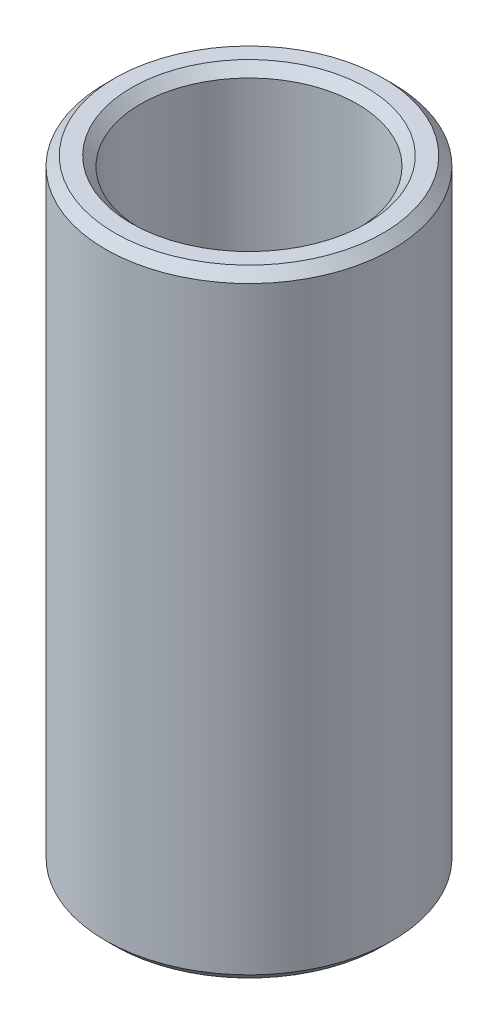
ISO-10303-21;
HEADER;
FILE_DESCRIPTION(('STEP AP214'),'2;1');
FILE_NAME('part.step','',(''),(''),'','','');
FILE_SCHEMA(('AUTOMOTIVE_DESIGN { 1 0 10303 214 1 1 1 1 }'));
ENDSEC;
DATA;
#1=APPLICATION_CONTEXT('core data for automotive mechanical design processes');
#2=APPLICATION_PROTOCOL_DEFINITION('international standard','automotive_design',2000,#1);
#3=PRODUCT_CONTEXT('',#1,'mechanical');
#4=PRODUCT('Part','Part','',(#3));
#5=PRODUCT_RELATED_PRODUCT_CATEGORY('part','',(#4));
#6=PRODUCT_DEFINITION_FORMATION('','',#4);
#7=PRODUCT_DEFINITION_CONTEXT('part definition',#1,'design');
#8=PRODUCT_DEFINITION('design','',#6,#7);
#9=PRODUCT_DEFINITION_SHAPE('','',#8);
#10=(LENGTH_UNIT() NAMED_UNIT(*) SI_UNIT(.MILLI.,.METRE.));
#11=(NAMED_UNIT(*) PLANE_ANGLE_UNIT() SI_UNIT($,.RADIAN.));
#12=(NAMED_UNIT(*) SI_UNIT($,.STERADIAN.) SOLID_ANGLE_UNIT());
#13=UNCERTAINTY_MEASURE_WITH_UNIT(LENGTH_MEASURE(1.E-05),#10,'distance_accuracy_value','');
#14=(GEOMETRIC_REPRESENTATION_CONTEXT(3) GLOBAL_UNCERTAINTY_ASSIGNED_CONTEXT((#13)) GLOBAL_UNIT_ASSIGNED_CONTEXT((#10,
#11,#12)) REPRESENTATION_CONTEXT('',''));
#15=CARTESIAN_POINT('',(0.,0.,0.));
#16=DIRECTION('',(0.,0.,1.));
#17=DIRECTION('',(1.,0.,0.));
#18=AXIS2_PLACEMENT_3D('',#15,#16,#17);
#19=CARTESIAN_POINT('',(0.,215.045325790434,0.));
#20=DIRECTION('',(0.,-1.,0.));
#21=DIRECTION('',(0.,0.,-1.));
#22=AXIS2_PLACEMENT_3D('',#19,#20,#21);
#23=CYLINDRICAL_SURFACE('',#22,50.);
#24=CARTESIAN_POINT('',(0.,3.25867300442437,0.));
#25=DIRECTION('',(0.,1.,0.));
#26=DIRECTION('',(0.,0.,1.));
#27=AXIS2_PLACEMENT_3D('',#24,#25,#26);
#28=CIRCLE('',#27,50.);
#29=CARTESIAN_POINT('',(0.,3.25867300442437,50.));
#30=VERTEX_POINT('',#29);
#31=EDGE_CURVE('E10',#30,#30,#28,.T.);
#32=ORIENTED_EDGE('',*,*,#31,.T.);
#33=EDGE_LOOP('',(#32));
#34=FACE_BOUND('',#33,.T.);
#35=CARTESIAN_POINT('',(0.,211.786652786009,0.));
#36=DIRECTION('',(0.,1.,0.));
#37=DIRECTION('',(0.,0.,1.));
#38=AXIS2_PLACEMENT_3D('',#35,#36,#37);
#39=CIRCLE('',#38,50.);
#40=CARTESIAN_POINT('',(0.,211.786652786009,50.));
#41=VERTEX_POINT('',#40);
#42=EDGE_CURVE('E50',#41,#41,#39,.F.);
#43=ORIENTED_EDGE('',*,*,#42,.T.);
#44=EDGE_LOOP('',(#43));
#45=FACE_BOUND('',#44,.T.);
#46=ADVANCED_FACE('F39',(#34,#45),#23,.T.);
#47=CARTESIAN_POINT('',(0.,215.045325790434,0.));
#48=DIRECTION('',(0.,1.,0.));
#49=DIRECTION('',(0.,0.,1.));
#50=AXIS2_PLACEMENT_3D('',#47,#48,#49);
#51=PLANE('',#50);
#52=CARTESIAN_POINT('',(0.,215.045325790434,0.));
#53=DIRECTION('',(0.,1.,0.));
#54=DIRECTION('',(0.,0.,1.));
#55=AXIS2_PLACEMENT_3D('',#52,#53,#54);
#56=CIRCLE('',#55,40.9631881952522);
#57=CARTESIAN_POINT('',(0.,215.045325790434,40.9631881952522));
#58=VERTEX_POINT('',#57);
#59=EDGE_CURVE('E58',#58,#58,#56,.F.);
#60=ORIENTED_EDGE('',*,*,#59,.T.);
#61=EDGE_LOOP('',(#60));
#62=FACE_BOUND('',#61,.T.);
#63=CARTESIAN_POINT('',(0.,215.045325790434,0.));
#64=DIRECTION('',(0.,1.,0.));
#65=DIRECTION('',(0.,0.,1.));
#66=AXIS2_PLACEMENT_3D('',#63,#64,#65);
#67=CIRCLE('',#66,46.7413269955755);
#68=CARTESIAN_POINT('',(0.,215.045325790434,46.7413269955755));
#69=VERTEX_POINT('',#68);
#70=EDGE_CURVE('E61',#69,#69,#67,.T.);
#71=ORIENTED_EDGE('',*,*,#70,.T.);
#72=EDGE_LOOP('',(#71));
#73=FACE_BOUND('',#72,.T.);
#74=ADVANCED_FACE('F88',(#62,#73),#51,.T.);
#75=CARTESIAN_POINT('',(0.,0.,0.));
#76=DIRECTION('',(0.,1.,0.));
#77=DIRECTION('',(0.,0.,1.));
#78=AXIS2_PLACEMENT_3D('',#75,#76,#77);
#79=PLANE('',#78);
#80=CARTESIAN_POINT('',(0.,0.,0.));
#81=DIRECTION('',(0.,1.,0.));
#82=DIRECTION('',(0.,0.,1.));
#83=AXIS2_PLACEMENT_3D('',#80,#81,#82);
#84=CIRCLE('',#83,40.9631881952522);
#85=CARTESIAN_POINT('',(0.,0.,40.9631881952522));
#86=VERTEX_POINT('',#85);
#87=EDGE_CURVE('E51',#86,#86,#84,.T.);
#88=ORIENTED_EDGE('',*,*,#87,.T.);
#89=EDGE_LOOP('',(#88));
#90=FACE_BOUND('',#89,.T.);
#91=CARTESIAN_POINT('',(0.,0.,0.));
#92=DIRECTION('',(0.,1.,0.));
#93=DIRECTION('',(0.,0.,1.));
#94=AXIS2_PLACEMENT_3D('',#91,#92,#93);
#95=CIRCLE('',#94,46.7413269955756);
#96=CARTESIAN_POINT('',(0.,0.,46.7413269955756));
#97=VERTEX_POINT('',#96);
#98=EDGE_CURVE('E54',#97,#97,#95,.F.);
#99=ORIENTED_EDGE('',*,*,#98,.T.);
#100=EDGE_LOOP('',(#99));
#101=FACE_BOUND('',#100,.T.);
#102=ADVANCED_FACE('F83',(#90,#101),#79,.F.);
#103=CARTESIAN_POINT('',(0.,215.045325790434,0.));
#104=DIRECTION('',(0.,-1.,0.));
#105=DIRECTION('',(0.,0.,-1.));
#106=AXIS2_PLACEMENT_3D('',#103,#104,#105);
#107=CYLINDRICAL_SURFACE('',#106,37.7045151908278);
#108=CARTESIAN_POINT('',(0.,211.786652786009,0.));
#109=DIRECTION('',(0.,1.,0.));
#110=DIRECTION('',(0.,0.,1.));
#111=AXIS2_PLACEMENT_3D('',#108,#109,#110);
#112=CIRCLE('',#111,37.7045151908278);
#113=CARTESIAN_POINT('',(0.,211.786652786009,37.7045151908278));
#114=VERTEX_POINT('',#113);
#115=EDGE_CURVE('E67',#114,#114,#112,.T.);
#116=ORIENTED_EDGE('',*,*,#115,.T.);
#117=EDGE_LOOP('',(#116));
#118=FACE_BOUND('',#117,.T.);
#119=CARTESIAN_POINT('',(0.,3.25867300442445,0.));
#120=DIRECTION('',(0.,1.,0.));
#121=DIRECTION('',(0.,0.,1.));
#122=AXIS2_PLACEMENT_3D('',#119,#120,#121);
#123=CIRCLE('',#122,37.7045151908278);
#124=CARTESIAN_POINT('',(0.,3.25867300442445,37.7045151908278));
#125=VERTEX_POINT('',#124);
#126=EDGE_CURVE('E69',#125,#125,#123,.F.);
#127=ORIENTED_EDGE('',*,*,#126,.T.);
#128=EDGE_LOOP('',(#127));
#129=FACE_BOUND('',#128,.T.);
#130=ADVANCED_FACE('F71',(#118,#129),#107,.F.);
#131=CARTESIAN_POINT('',(0.,211.786652786009,0.));
#132=DIRECTION('',(0.,1.,0.));
#133=DIRECTION('',(0.,0.,1.));
#134=AXIS2_PLACEMENT_3D('',#131,#132,#133);
#135=CONICAL_SURFACE('',#134,37.7045151908278,0.785398163397448);
#136=ORIENTED_EDGE('',*,*,#59,.F.);
#137=EDGE_LOOP('',(#136));
#138=FACE_BOUND('',#137,.T.);
#139=ORIENTED_EDGE('',*,*,#115,.F.);
#140=EDGE_LOOP('',(#139));
#141=FACE_BOUND('',#140,.T.);
#142=ADVANCED_FACE('F77',(#138,#141),#135,.F.);
#143=CARTESIAN_POINT('',(0.,0.,0.));
#144=DIRECTION('',(0.,-1.,0.));
#145=DIRECTION('',(0.,0.,-1.));
#146=AXIS2_PLACEMENT_3D('',#143,#144,#145);
#147=CONICAL_SURFACE('',#146,40.9631881952522,0.785398163397448);
#148=ORIENTED_EDGE('',*,*,#126,.F.);
#149=EDGE_LOOP('',(#148));
#150=FACE_BOUND('',#149,.T.);
#151=ORIENTED_EDGE('',*,*,#87,.F.);
#152=EDGE_LOOP('',(#151));
#153=FACE_BOUND('',#152,.T.);
#154=ADVANCED_FACE('F73',(#150,#153),#147,.F.);
#155=CARTESIAN_POINT('',(0.,3.25867300442437,0.));
#156=DIRECTION('',(0.,1.,0.));
#157=DIRECTION('',(0.,0.,1.));
#158=AXIS2_PLACEMENT_3D('',#155,#156,#157);
#159=CONICAL_SURFACE('',#158,50.,0.785398163397449);
#160=ORIENTED_EDGE('',*,*,#98,.F.);
#161=EDGE_LOOP('',(#160));
#162=FACE_BOUND('',#161,.T.);
#163=ORIENTED_EDGE('',*,*,#31,.F.);
#164=EDGE_LOOP('',(#163));
#165=FACE_BOUND('',#164,.T.);
#166=ADVANCED_FACE('F76',(#162,#165),#159,.T.);
#167=CARTESIAN_POINT('',(0.,215.045325790434,0.));
#168=DIRECTION('',(0.,-1.,0.));
#169=DIRECTION('',(0.,0.,-1.));
#170=AXIS2_PLACEMENT_3D('',#167,#168,#169);
#171=CONICAL_SURFACE('',#170,46.7413269955755,0.785398163397447);
#172=ORIENTED_EDGE('',*,*,#42,.F.);
#173=EDGE_LOOP('',(#172));
#174=FACE_BOUND('',#173,.T.);
#175=ORIENTED_EDGE('',*,*,#70,.F.);
#176=EDGE_LOOP('',(#175));
#177=FACE_BOUND('',#176,.T.);
#178=ADVANCED_FACE('F45',(#174,#177),#171,.T.);
#179=CLOSED_SHELL('',(#46,#74,#102,#130,#142,#154,#166,#178));
#180=MANIFOLD_SOLID_BREP('B2',#179);
#181=ADVANCED_BREP_SHAPE_REPRESENTATION('',(#18,#180),#14);
#182=SHAPE_DEFINITION_REPRESENTATION(#9,#181);
ENDSEC;
END-ISO-10303-21;
